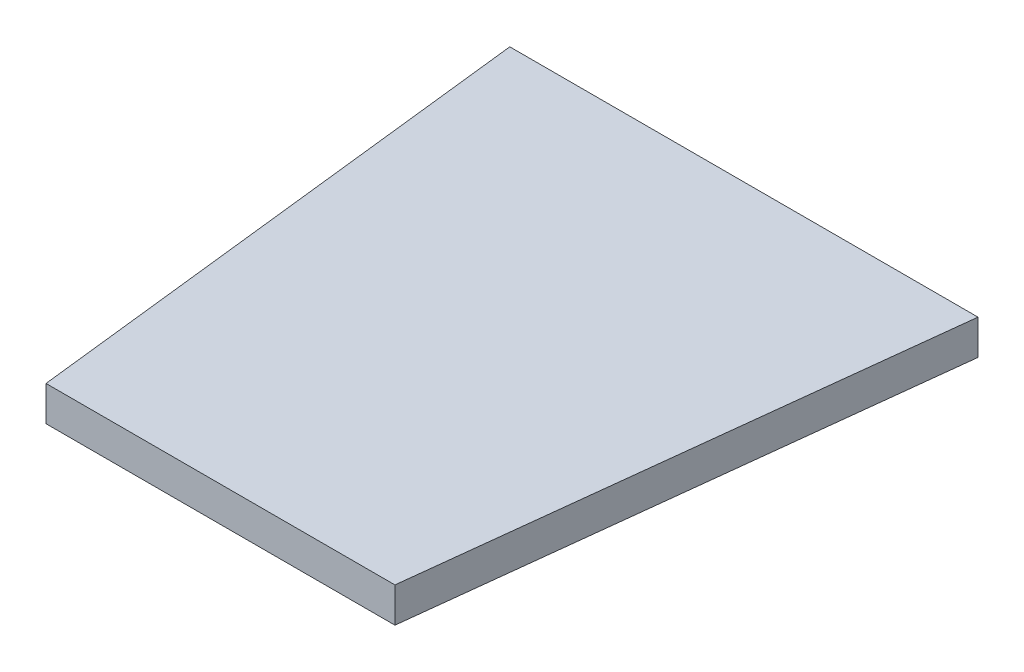
ISO-10303-21;
HEADER;
FILE_DESCRIPTION(('STEP AP214'),'2;1');
FILE_NAME('part.step','',(''),(''),'','','');
FILE_SCHEMA(('AUTOMOTIVE_DESIGN { 1 0 10303 214 1 1 1 1 }'));
ENDSEC;
DATA;
#1=APPLICATION_CONTEXT('core data for automotive mechanical design processes');
#2=APPLICATION_PROTOCOL_DEFINITION('international standard','automotive_design',2000,#1);
#3=PRODUCT_CONTEXT('',#1,'mechanical');
#4=PRODUCT('Part','Part','',(#3));
#5=PRODUCT_RELATED_PRODUCT_CATEGORY('part','',(#4));
#6=PRODUCT_DEFINITION_FORMATION('','',#4);
#7=PRODUCT_DEFINITION_CONTEXT('part definition',#1,'design');
#8=PRODUCT_DEFINITION('design','',#6,#7);
#9=PRODUCT_DEFINITION_SHAPE('','',#8);
#10=(LENGTH_UNIT() NAMED_UNIT(*) SI_UNIT(.MILLI.,.METRE.));
#11=(NAMED_UNIT(*) PLANE_ANGLE_UNIT() SI_UNIT($,.RADIAN.));
#12=(NAMED_UNIT(*) SI_UNIT($,.STERADIAN.) SOLID_ANGLE_UNIT());
#13=UNCERTAINTY_MEASURE_WITH_UNIT(LENGTH_MEASURE(1.E-05),#10,'distance_accuracy_value','');
#14=(GEOMETRIC_REPRESENTATION_CONTEXT(3) GLOBAL_UNCERTAINTY_ASSIGNED_CONTEXT((#13)) GLOBAL_UNIT_ASSIGNED_CONTEXT((#10,
#11,#12)) REPRESENTATION_CONTEXT('',''));
#15=CARTESIAN_POINT('',(0.,0.,0.));
#16=DIRECTION('',(0.,0.,1.));
#17=DIRECTION('',(1.,0.,0.));
#18=AXIS2_PLACEMENT_3D('',#15,#16,#17);
#19=CARTESIAN_POINT('',(-20.1271023735741,3.,-99.5));
#20=DIRECTION('',(0.,0.,1.));
#21=DIRECTION('',(1.,0.,0.));
#22=AXIS2_PLACEMENT_3D('',#19,#20,#21);
#23=PLANE('',#22);
#24=DIRECTION('',(-1.,0.,0.));
#25=VECTOR('',#24,1.);
#26=CARTESIAN_POINT('',(-20.1271023735741,0.,-99.5));
#27=LINE('',#26,#25);
#28=CARTESIAN_POINT('',(20.1271023735741,0.,-99.5));
#29=VERTEX_POINT('',#28);
#30=CARTESIAN_POINT('',(-20.1271023735741,0.,-99.5));
#31=VERTEX_POINT('',#30);
#32=EDGE_CURVE('E76',#29,#31,#27,.T.);
#33=ORIENTED_EDGE('',*,*,#32,.T.);
#34=DIRECTION('',(0.,-1.,0.));
#35=VECTOR('',#34,1.);
#36=CARTESIAN_POINT('',(-20.1271023735741,3.,-99.5));
#37=LINE('',#36,#35);
#38=CARTESIAN_POINT('',(-20.1271023735741,3.,-99.5));
#39=VERTEX_POINT('',#38);
#40=EDGE_CURVE('E11',#39,#31,#37,.T.);
#41=ORIENTED_EDGE('',*,*,#40,.F.);
#42=DIRECTION('',(-1.,0.,0.));
#43=VECTOR('',#42,1.);
#44=CARTESIAN_POINT('',(-20.1271023735741,3.,-99.5));
#45=LINE('',#44,#43);
#46=CARTESIAN_POINT('',(20.1271023735741,3.,-99.5));
#47=VERTEX_POINT('',#46);
#48=EDGE_CURVE('E67',#47,#39,#45,.T.);
#49=ORIENTED_EDGE('',*,*,#48,.F.);
#50=DIRECTION('',(0.,-1.,0.));
#51=VECTOR('',#50,1.);
#52=CARTESIAN_POINT('',(20.1271023735741,3.,-99.5));
#53=LINE('',#52,#51);
#54=EDGE_CURVE('E82',#47,#29,#53,.T.);
#55=ORIENTED_EDGE('',*,*,#54,.T.);
#56=EDGE_LOOP('',(#33,#41,#49,#55));
#57=FACE_BOUND('',#56,.T.);
#58=ADVANCED_FACE('F33',(#57),#23,.F.);
#59=CARTESIAN_POINT('',(-20.1271023735741,3.,-99.5));
#60=DIRECTION('',(0.993571855676587,0.,-0.113203213767907));
#61=DIRECTION('',(-0.113203213767907,0.,-0.993571855676588));
#62=AXIS2_PLACEMENT_3D('',#59,#60,#61);
#63=PLANE('',#62);
#64=DIRECTION('',(0.113203213767907,0.,0.993571855676588));
#65=VECTOR('',#64,1.);
#66=CARTESIAN_POINT('',(-20.1271023735741,0.,-99.5));
#67=LINE('',#66,#65);
#68=CARTESIAN_POINT('',(-15.,0.,-54.5));
#69=VERTEX_POINT('',#68);
#70=EDGE_CURVE('E60',#31,#69,#67,.T.);
#71=ORIENTED_EDGE('',*,*,#70,.T.);
#72=DIRECTION('',(0.,-1.,0.));
#73=VECTOR('',#72,1.);
#74=CARTESIAN_POINT('',(-15.,3.,-54.5));
#75=LINE('',#74,#73);
#76=CARTESIAN_POINT('',(-15.,3.,-54.5));
#77=VERTEX_POINT('',#76);
#78=EDGE_CURVE('E41',#77,#69,#75,.T.);
#79=ORIENTED_EDGE('',*,*,#78,.F.);
#80=DIRECTION('',(0.113203213767907,0.,0.993571855676588));
#81=VECTOR('',#80,1.);
#82=CARTESIAN_POINT('',(-20.1271023735741,3.,-99.5));
#83=LINE('',#82,#81);
#84=EDGE_CURVE('E49',#39,#77,#83,.T.);
#85=ORIENTED_EDGE('',*,*,#84,.F.);
#86=ORIENTED_EDGE('',*,*,#40,.T.);
#87=EDGE_LOOP('',(#71,#79,#85,#86));
#88=FACE_BOUND('',#87,.T.);
#89=ADVANCED_FACE('F106',(#88),#63,.F.);
#90=CARTESIAN_POINT('',(0.,3.,-54.5));
#91=DIRECTION('',(0.,0.,-1.));
#92=DIRECTION('',(-1.,0.,0.));
#93=AXIS2_PLACEMENT_3D('',#90,#91,#92);
#94=PLANE('',#93);
#95=DIRECTION('',(1.,0.,0.));
#96=VECTOR('',#95,1.);
#97=CARTESIAN_POINT('',(0.,0.,-54.5));
#98=LINE('',#97,#96);
#99=CARTESIAN_POINT('',(15.,0.,-54.5));
#100=VERTEX_POINT('',#99);
#101=EDGE_CURVE('E96',#69,#100,#98,.T.);
#102=ORIENTED_EDGE('',*,*,#101,.T.);
#103=DIRECTION('',(0.,-1.,0.));
#104=VECTOR('',#103,1.);
#105=CARTESIAN_POINT('',(15.,3.,-54.5));
#106=LINE('',#105,#104);
#107=CARTESIAN_POINT('',(15.,3.,-54.5));
#108=VERTEX_POINT('',#107);
#109=EDGE_CURVE('E80',#108,#100,#106,.T.);
#110=ORIENTED_EDGE('',*,*,#109,.F.);
#111=DIRECTION('',(1.,0.,0.));
#112=VECTOR('',#111,1.);
#113=CARTESIAN_POINT('',(0.,3.,-54.5));
#114=LINE('',#113,#112);
#115=EDGE_CURVE('E98',#77,#108,#114,.T.);
#116=ORIENTED_EDGE('',*,*,#115,.F.);
#117=ORIENTED_EDGE('',*,*,#78,.T.);
#118=EDGE_LOOP('',(#102,#110,#116,#117));
#119=FACE_BOUND('',#118,.T.);
#120=ADVANCED_FACE('F104',(#119),#94,.F.);
#121=CARTESIAN_POINT('',(0.,3.,0.));
#122=DIRECTION('',(0.,-1.,0.));
#123=DIRECTION('',(0.,0.,-1.));
#124=AXIS2_PLACEMENT_3D('',#121,#122,#123);
#125=PLANE('',#124);
#126=ORIENTED_EDGE('',*,*,#48,.T.);
#127=ORIENTED_EDGE('',*,*,#84,.T.);
#128=ORIENTED_EDGE('',*,*,#115,.T.);
#129=DIRECTION('',(-0.113203213767907,0.,0.993571855676588));
#130=VECTOR('',#129,1.);
#131=CARTESIAN_POINT('',(20.1271023735741,3.,-99.5));
#132=LINE('',#131,#130);
#133=EDGE_CURVE('E86',#47,#108,#132,.T.);
#134=ORIENTED_EDGE('',*,*,#133,.F.);
#135=EDGE_LOOP('',(#126,#127,#128,#134));
#136=FACE_BOUND('',#135,.T.);
#137=ADVANCED_FACE('F107',(#136),#125,.F.);
#138=CARTESIAN_POINT('',(0.,0.,0.));
#139=DIRECTION('',(0.,-1.,0.));
#140=DIRECTION('',(0.,0.,-1.));
#141=AXIS2_PLACEMENT_3D('',#138,#139,#140);
#142=PLANE('',#141);
#143=ORIENTED_EDGE('',*,*,#32,.F.);
#144=DIRECTION('',(-0.113203213767907,0.,0.993571855676588));
#145=VECTOR('',#144,1.);
#146=CARTESIAN_POINT('',(20.1271023735741,0.,-99.5));
#147=LINE('',#146,#145);
#148=EDGE_CURVE('E79',#29,#100,#147,.T.);
#149=ORIENTED_EDGE('',*,*,#148,.T.);
#150=ORIENTED_EDGE('',*,*,#101,.F.);
#151=ORIENTED_EDGE('',*,*,#70,.F.);
#152=EDGE_LOOP('',(#143,#149,#150,#151));
#153=FACE_BOUND('',#152,.T.);
#154=ADVANCED_FACE('F77',(#153),#142,.T.);
#155=CARTESIAN_POINT('',(20.1271023735741,3.,-99.5));
#156=DIRECTION('',(0.993571855676587,0.,0.113203213767907));
#157=DIRECTION('',(0.113203213767907,0.,-0.993571855676588));
#158=AXIS2_PLACEMENT_3D('',#155,#156,#157);
#159=PLANE('',#158);
#160=ORIENTED_EDGE('',*,*,#148,.F.);
#161=ORIENTED_EDGE('',*,*,#54,.F.);
#162=ORIENTED_EDGE('',*,*,#133,.T.);
#163=ORIENTED_EDGE('',*,*,#109,.T.);
#164=EDGE_LOOP('',(#160,#161,#162,#163));
#165=FACE_BOUND('',#164,.T.);
#166=ADVANCED_FACE('F89',(#165),#159,.T.);
#167=CLOSED_SHELL('',(#58,#89,#120,#137,#154,#166));
#168=MANIFOLD_SOLID_BREP('B2',#167);
#169=ADVANCED_BREP_SHAPE_REPRESENTATION('',(#18,#168),#14);
#170=SHAPE_DEFINITION_REPRESENTATION(#9,#169);
ENDSEC;
END-ISO-10303-21;
